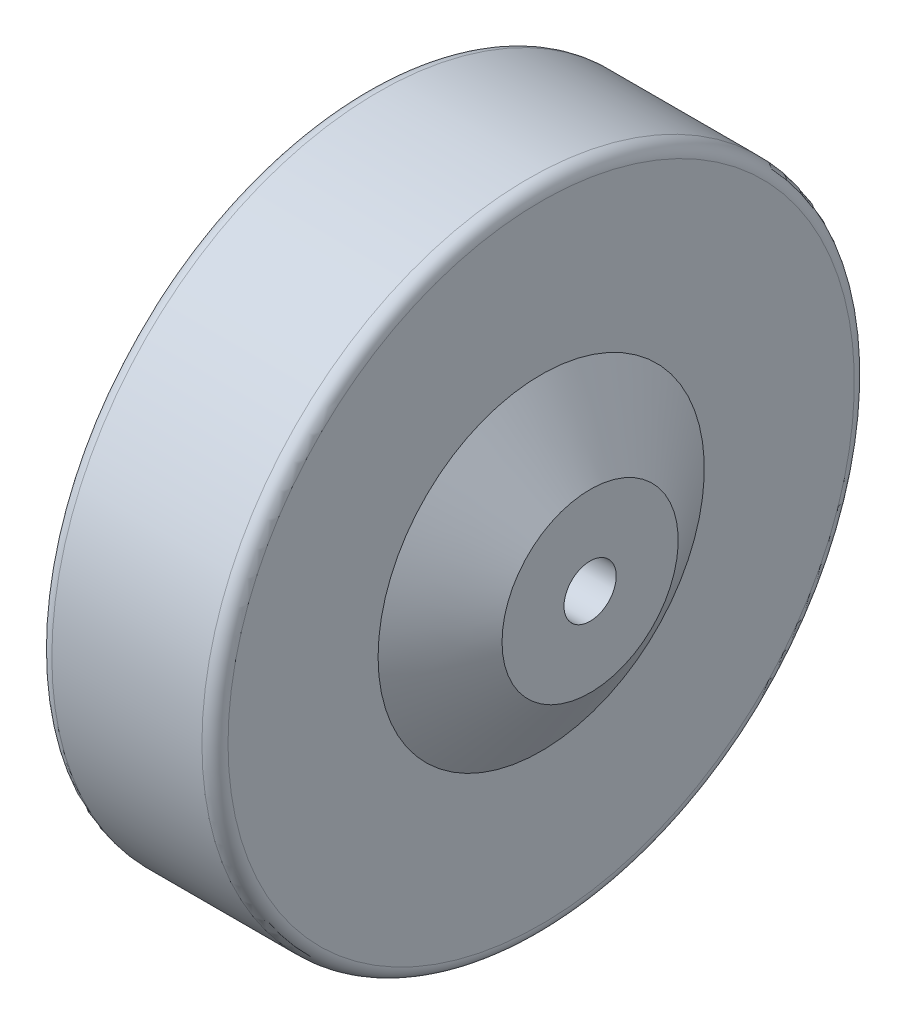
ISO-10303-21;
HEADER;
FILE_DESCRIPTION(('STEP AP214'),'2;1');
FILE_NAME('part.step','',(''),(''),'','','');
FILE_SCHEMA(('AUTOMOTIVE_DESIGN { 1 0 10303 214 1 1 1 1 }'));
ENDSEC;
DATA;
#1=APPLICATION_CONTEXT('core data for automotive mechanical design processes');
#2=APPLICATION_PROTOCOL_DEFINITION('international standard','automotive_design',2000,#1);
#3=PRODUCT_CONTEXT('',#1,'mechanical');
#4=PRODUCT('Part','Part','',(#3));
#5=PRODUCT_RELATED_PRODUCT_CATEGORY('part','',(#4));
#6=PRODUCT_DEFINITION_FORMATION('','',#4);
#7=PRODUCT_DEFINITION_CONTEXT('part definition',#1,'design');
#8=PRODUCT_DEFINITION('design','',#6,#7);
#9=PRODUCT_DEFINITION_SHAPE('','',#8);
#10=(LENGTH_UNIT() NAMED_UNIT(*) SI_UNIT(.MILLI.,.METRE.));
#11=(NAMED_UNIT(*) PLANE_ANGLE_UNIT() SI_UNIT($,.RADIAN.));
#12=(NAMED_UNIT(*) SI_UNIT($,.STERADIAN.) SOLID_ANGLE_UNIT());
#13=UNCERTAINTY_MEASURE_WITH_UNIT(LENGTH_MEASURE(1.E-05),#10,'distance_accuracy_value','');
#14=(GEOMETRIC_REPRESENTATION_CONTEXT(3) GLOBAL_UNCERTAINTY_ASSIGNED_CONTEXT((#13)) GLOBAL_UNIT_ASSIGNED_CONTEXT((#10,
#11,#12)) REPRESENTATION_CONTEXT('',''));
#15=CARTESIAN_POINT('',(0.,0.,0.));
#16=DIRECTION('',(0.,0.,1.));
#17=DIRECTION('',(1.,0.,0.));
#18=AXIS2_PLACEMENT_3D('',#15,#16,#17);
#19=CARTESIAN_POINT('',(20.9999999999999,0.,0.));
#20=DIRECTION('',(-1.,0.,0.));
#21=DIRECTION('',(0.,0.,1.));
#22=AXIS2_PLACEMENT_3D('',#19,#20,#21);
#23=CONICAL_SURFACE('',#22,13.5000000000002,0.992894389832632);
#24=CARTESIAN_POINT('',(13.4999999999997,0.,0.));
#25=DIRECTION('',(-1.,0.,0.));
#26=DIRECTION('',(0.,0.,1.));
#27=AXIS2_PLACEMENT_3D('',#24,#25,#26);
#28=CIRCLE('',#27,25.);
#29=CARTESIAN_POINT('',(13.4999999999997,0.,25.));
#30=VERTEX_POINT('',#29);
#31=EDGE_CURVE('E10',#30,#30,#28,.T.);
#32=ORIENTED_EDGE('',*,*,#31,.F.);
#33=EDGE_LOOP('',(#32));
#34=FACE_BOUND('',#33,.T.);
#35=CARTESIAN_POINT('',(20.9999999999999,0.,0.));
#36=DIRECTION('',(-1.,0.,0.));
#37=DIRECTION('',(0.,0.,1.));
#38=AXIS2_PLACEMENT_3D('',#35,#36,#37);
#39=CIRCLE('',#38,13.5000000000002);
#40=CARTESIAN_POINT('',(20.9999999999999,0.,13.5000000000002));
#41=VERTEX_POINT('',#40);
#42=EDGE_CURVE('E67',#41,#41,#39,.T.);
#43=ORIENTED_EDGE('',*,*,#42,.T.);
#44=EDGE_LOOP('',(#43));
#45=FACE_BOUND('',#44,.T.);
#46=ADVANCED_FACE('F33',(#34,#45),#23,.T.);
#47=CARTESIAN_POINT('',(13.4999999999997,25.,0.));
#48=DIRECTION('',(-1.,0.,0.));
#49=DIRECTION('',(0.,0.,1.));
#50=AXIS2_PLACEMENT_3D('',#47,#48,#49);
#51=PLANE('',#50);
#52=CARTESIAN_POINT('',(13.4999999999996,0.,0.));
#53=DIRECTION('',(-1.,0.,0.));
#54=DIRECTION('',(0.,0.,1.));
#55=AXIS2_PLACEMENT_3D('',#52,#53,#54);
#56=CIRCLE('',#55,48.0000000000002);
#57=CARTESIAN_POINT('',(13.4999999999996,0.,48.0000000000002));
#58=VERTEX_POINT('',#57);
#59=EDGE_CURVE('E39',#58,#58,#56,.T.);
#60=ORIENTED_EDGE('',*,*,#59,.F.);
#61=EDGE_LOOP('',(#60));
#62=FACE_BOUND('',#61,.T.);
#63=ORIENTED_EDGE('',*,*,#31,.T.);
#64=EDGE_LOOP('',(#63));
#65=FACE_BOUND('',#64,.T.);
#66=ADVANCED_FACE('F116',(#62,#65),#51,.F.);
#67=CARTESIAN_POINT('',(11.4999999999997,0.,0.));
#68=DIRECTION('',(-1.,0.,0.));
#69=DIRECTION('',(0.,0.,1.));
#70=AXIS2_PLACEMENT_3D('',#67,#68,#69);
#71=TOROIDAL_SURFACE('',#70,48.0000000000002,2.);
#72=CARTESIAN_POINT('',(11.4999999999998,0.,0.));
#73=DIRECTION('',(-1.,0.,0.));
#74=DIRECTION('',(0.,0.,1.));
#75=AXIS2_PLACEMENT_3D('',#72,#73,#74);
#76=CIRCLE('',#75,50.0000000000002);
#77=CARTESIAN_POINT('',(11.4999999999998,0.,50.0000000000002));
#78=VERTEX_POINT('',#77);
#79=EDGE_CURVE('E43',#78,#78,#76,.T.);
#80=ORIENTED_EDGE('',*,*,#79,.F.);
#81=EDGE_LOOP('',(#80));
#82=FACE_BOUND('',#81,.T.);
#83=ORIENTED_EDGE('',*,*,#59,.T.);
#84=EDGE_LOOP('',(#83));
#85=FACE_BOUND('',#84,.T.);
#86=ADVANCED_FACE('F111',(#82,#85),#71,.T.);
#87=CARTESIAN_POINT('',(-557.663253442253,0.,0.));
#88=DIRECTION('',(-1.,0.,0.));
#89=DIRECTION('',(0.,0.,1.));
#90=AXIS2_PLACEMENT_3D('',#87,#88,#89);
#91=CYLINDRICAL_SURFACE('',#90,50.0000000000002);
#92=CARTESIAN_POINT('',(-11.5000000000002,0.,0.));
#93=DIRECTION('',(-1.,0.,0.));
#94=DIRECTION('',(0.,0.,1.));
#95=AXIS2_PLACEMENT_3D('',#92,#93,#94);
#96=CIRCLE('',#95,50.0000000000002);
#97=CARTESIAN_POINT('',(-11.5000000000002,0.,50.0000000000002));
#98=VERTEX_POINT('',#97);
#99=EDGE_CURVE('E47',#98,#98,#96,.T.);
#100=ORIENTED_EDGE('',*,*,#99,.F.);
#101=EDGE_LOOP('',(#100));
#102=FACE_BOUND('',#101,.T.);
#103=ORIENTED_EDGE('',*,*,#79,.T.);
#104=EDGE_LOOP('',(#103));
#105=FACE_BOUND('',#104,.T.);
#106=ADVANCED_FACE('F105',(#102,#105),#91,.T.);
#107=CARTESIAN_POINT('',(-11.5,0.,0.));
#108=DIRECTION('',(-1.,0.,0.));
#109=DIRECTION('',(0.,0.,1.));
#110=AXIS2_PLACEMENT_3D('',#107,#108,#109);
#111=TOROIDAL_SURFACE('',#110,48.0000000000002,2.);
#112=CARTESIAN_POINT('',(-13.5,0.,0.));
#113=DIRECTION('',(-1.,0.,0.));
#114=DIRECTION('',(0.,0.,1.));
#115=AXIS2_PLACEMENT_3D('',#112,#113,#114);
#116=CIRCLE('',#115,48.0000000000002);
#117=CARTESIAN_POINT('',(-13.5,0.,48.0000000000002));
#118=VERTEX_POINT('',#117);
#119=EDGE_CURVE('E52',#118,#118,#116,.T.);
#120=ORIENTED_EDGE('',*,*,#119,.F.);
#121=EDGE_LOOP('',(#120));
#122=FACE_BOUND('',#121,.T.);
#123=ORIENTED_EDGE('',*,*,#99,.T.);
#124=EDGE_LOOP('',(#123));
#125=FACE_BOUND('',#124,.T.);
#126=ADVANCED_FACE('F99',(#122,#125),#111,.T.);
#127=CARTESIAN_POINT('',(-13.5,25.,0.));
#128=DIRECTION('',(1.,0.,0.));
#129=DIRECTION('',(0.,0.,-1.));
#130=AXIS2_PLACEMENT_3D('',#127,#128,#129);
#131=PLANE('',#130);
#132=CARTESIAN_POINT('',(-13.5,0.,0.));
#133=DIRECTION('',(-1.,0.,0.));
#134=DIRECTION('',(0.,0.,1.));
#135=AXIS2_PLACEMENT_3D('',#132,#133,#134);
#136=CIRCLE('',#135,25.);
#137=CARTESIAN_POINT('',(-13.5,0.,25.));
#138=VERTEX_POINT('',#137);
#139=EDGE_CURVE('E55',#138,#138,#136,.T.);
#140=ORIENTED_EDGE('',*,*,#139,.F.);
#141=EDGE_LOOP('',(#140));
#142=FACE_BOUND('',#141,.T.);
#143=ORIENTED_EDGE('',*,*,#119,.T.);
#144=EDGE_LOOP('',(#143));
#145=FACE_BOUND('',#144,.T.);
#146=ADVANCED_FACE('F93',(#142,#145),#131,.F.);
#147=CARTESIAN_POINT('',(-13.5,0.,0.));
#148=DIRECTION('',(1.,0.,0.));
#149=DIRECTION('',(0.,0.,-1.));
#150=AXIS2_PLACEMENT_3D('',#147,#148,#149);
#151=CONICAL_SURFACE('',#150,25.,0.992894389832647);
#152=CARTESIAN_POINT('',(-21.,0.,0.));
#153=DIRECTION('',(-1.,0.,0.));
#154=DIRECTION('',(0.,0.,1.));
#155=AXIS2_PLACEMENT_3D('',#152,#153,#154);
#156=CIRCLE('',#155,13.5);
#157=CARTESIAN_POINT('',(-21.,0.,13.5));
#158=VERTEX_POINT('',#157);
#159=EDGE_CURVE('E58',#158,#158,#156,.T.);
#160=ORIENTED_EDGE('',*,*,#159,.F.);
#161=EDGE_LOOP('',(#160));
#162=FACE_BOUND('',#161,.T.);
#163=ORIENTED_EDGE('',*,*,#139,.T.);
#164=EDGE_LOOP('',(#163));
#165=FACE_BOUND('',#164,.T.);
#166=ADVANCED_FACE('F87',(#162,#165),#151,.T.);
#167=CARTESIAN_POINT('',(-21.,4.,0.));
#168=DIRECTION('',(1.,0.,0.));
#169=DIRECTION('',(0.,0.,-1.));
#170=AXIS2_PLACEMENT_3D('',#167,#168,#169);
#171=PLANE('',#170);
#172=CARTESIAN_POINT('',(-21.,0.,0.));
#173=DIRECTION('',(-1.,0.,0.));
#174=DIRECTION('',(0.,0.,1.));
#175=AXIS2_PLACEMENT_3D('',#172,#173,#174);
#176=CIRCLE('',#175,4.);
#177=CARTESIAN_POINT('',(-21.,0.,4.));
#178=VERTEX_POINT('',#177);
#179=EDGE_CURVE('E61',#178,#178,#176,.T.);
#180=ORIENTED_EDGE('',*,*,#179,.F.);
#181=EDGE_LOOP('',(#180));
#182=FACE_BOUND('',#181,.T.);
#183=ORIENTED_EDGE('',*,*,#159,.T.);
#184=EDGE_LOOP('',(#183));
#185=FACE_BOUND('',#184,.T.);
#186=ADVANCED_FACE('F81',(#182,#185),#171,.F.);
#187=CARTESIAN_POINT('',(-557.663253442253,0.,0.));
#188=DIRECTION('',(-1.,0.,0.));
#189=DIRECTION('',(0.,0.,1.));
#190=AXIS2_PLACEMENT_3D('',#187,#188,#189);
#191=CYLINDRICAL_SURFACE('',#190,4.00000000000011);
#192=CARTESIAN_POINT('',(21.,0.,0.));
#193=DIRECTION('',(-1.,0.,0.));
#194=DIRECTION('',(0.,0.,1.));
#195=AXIS2_PLACEMENT_3D('',#192,#193,#194);
#196=CIRCLE('',#195,4.00000000000022);
#197=CARTESIAN_POINT('',(21.,0.,4.00000000000022));
#198=VERTEX_POINT('',#197);
#199=EDGE_CURVE('E64',#198,#198,#196,.T.);
#200=ORIENTED_EDGE('',*,*,#199,.F.);
#201=EDGE_LOOP('',(#200));
#202=FACE_BOUND('',#201,.T.);
#203=ORIENTED_EDGE('',*,*,#179,.T.);
#204=EDGE_LOOP('',(#203));
#205=FACE_BOUND('',#204,.T.);
#206=ADVANCED_FACE('F75',(#202,#205),#191,.F.);
#207=CARTESIAN_POINT('',(21.,4.00000000000022,0.));
#208=DIRECTION('',(-1.,0.,0.));
#209=DIRECTION('',(0.,0.,1.));
#210=AXIS2_PLACEMENT_3D('',#207,#208,#209);
#211=PLANE('',#210);
#212=ORIENTED_EDGE('',*,*,#42,.F.);
#213=EDGE_LOOP('',(#212));
#214=FACE_BOUND('',#213,.T.);
#215=ORIENTED_EDGE('',*,*,#199,.T.);
#216=EDGE_LOOP('',(#215));
#217=FACE_BOUND('',#216,.T.);
#218=ADVANCED_FACE('F72',(#214,#217),#211,.F.);
#219=CLOSED_SHELL('',(#46,#66,#86,#106,#126,#146,#166,#186,#206,#218));
#220=MANIFOLD_SOLID_BREP('B2',#219);
#221=ADVANCED_BREP_SHAPE_REPRESENTATION('',(#18,#220),#14);
#222=SHAPE_DEFINITION_REPRESENTATION(#9,#221);
ENDSEC;
END-ISO-10303-21;
